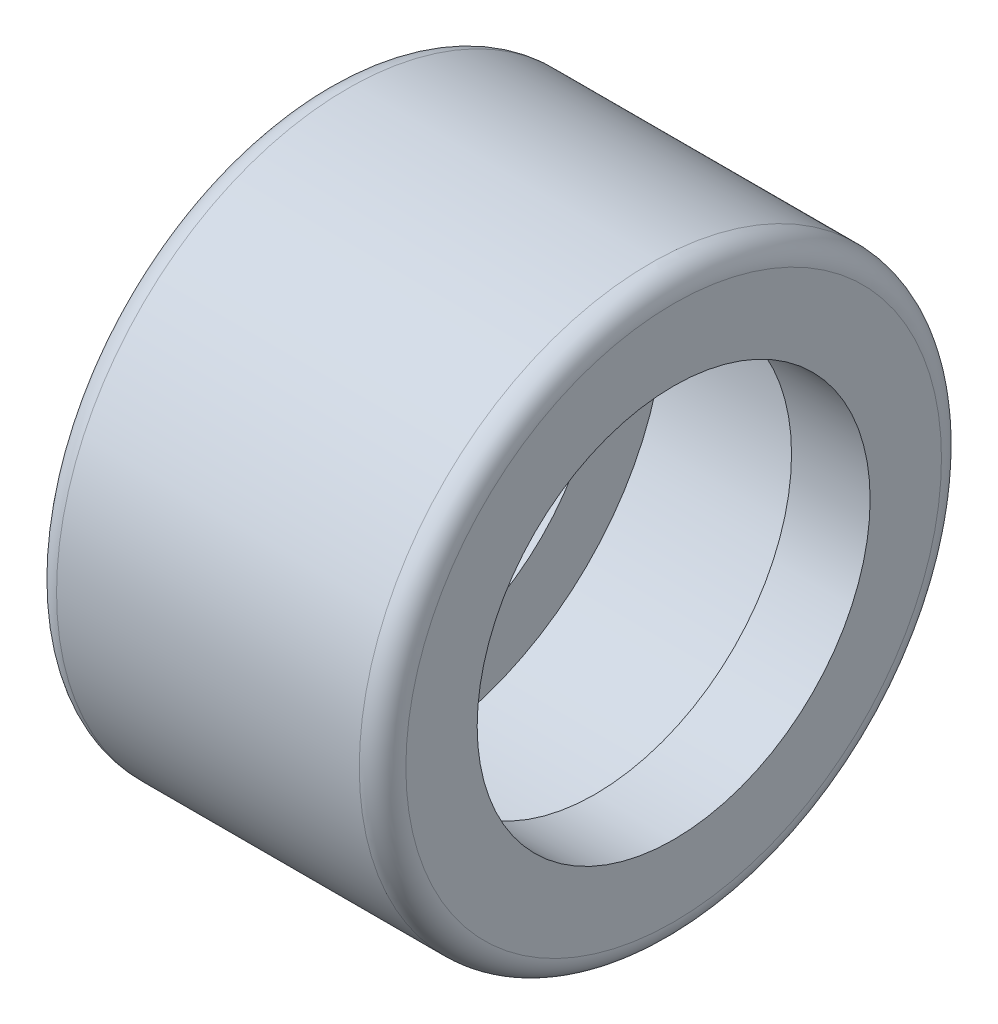
ISO-10303-21;
HEADER;
FILE_DESCRIPTION(('STEP AP214'),'2;1');
FILE_NAME('part.step','',(''),(''),'','','');
FILE_SCHEMA(('AUTOMOTIVE_DESIGN { 1 0 10303 214 1 1 1 1 }'));
ENDSEC;
DATA;
#1=APPLICATION_CONTEXT('core data for automotive mechanical design processes');
#2=APPLICATION_PROTOCOL_DEFINITION('international standard','automotive_design',2000,#1);
#3=PRODUCT_CONTEXT('',#1,'mechanical');
#4=PRODUCT('Part','Part','',(#3));
#5=PRODUCT_RELATED_PRODUCT_CATEGORY('part','',(#4));
#6=PRODUCT_DEFINITION_FORMATION('','',#4);
#7=PRODUCT_DEFINITION_CONTEXT('part definition',#1,'design');
#8=PRODUCT_DEFINITION('design','',#6,#7);
#9=PRODUCT_DEFINITION_SHAPE('','',#8);
#10=(LENGTH_UNIT() NAMED_UNIT(*) SI_UNIT(.MILLI.,.METRE.));
#11=(NAMED_UNIT(*) PLANE_ANGLE_UNIT() SI_UNIT($,.RADIAN.));
#12=(NAMED_UNIT(*) SI_UNIT($,.STERADIAN.) SOLID_ANGLE_UNIT());
#13=UNCERTAINTY_MEASURE_WITH_UNIT(LENGTH_MEASURE(1.E-05),#10,'distance_accuracy_value','');
#14=(GEOMETRIC_REPRESENTATION_CONTEXT(3) GLOBAL_UNCERTAINTY_ASSIGNED_CONTEXT((#13)) GLOBAL_UNIT_ASSIGNED_CONTEXT((#10,
#11,#12)) REPRESENTATION_CONTEXT('',''));
#15=CARTESIAN_POINT('',(0.,0.,0.));
#16=DIRECTION('',(0.,0.,1.));
#17=DIRECTION('',(1.,0.,0.));
#18=AXIS2_PLACEMENT_3D('',#15,#16,#17);
#19=CARTESIAN_POINT('',(0.40000000000003,0.,0.));
#20=DIRECTION('',(-1.,0.,0.));
#21=DIRECTION('',(0.,0.,1.));
#22=AXIS2_PLACEMENT_3D('',#19,#20,#21);
#23=TOROIDAL_SURFACE('',#22,4.59999999999997,0.40000000000003);
#24=CARTESIAN_POINT('',(0.,0.,0.));
#25=DIRECTION('',(-1.,0.,0.));
#26=DIRECTION('',(0.,0.,1.));
#27=AXIS2_PLACEMENT_3D('',#24,#25,#26);
#28=CIRCLE('',#27,4.6);
#29=CARTESIAN_POINT('',(0.,0.,4.6));
#30=VERTEX_POINT('',#29);
#31=EDGE_CURVE('E10',#30,#30,#28,.T.);
#32=ORIENTED_EDGE('',*,*,#31,.F.);
#33=EDGE_LOOP('',(#32));
#34=FACE_BOUND('',#33,.T.);
#35=CARTESIAN_POINT('',(0.399999999999998,0.,0.));
#36=DIRECTION('',(-1.,0.,0.));
#37=DIRECTION('',(0.,0.,1.));
#38=AXIS2_PLACEMENT_3D('',#35,#36,#37);
#39=CIRCLE('',#38,5.);
#40=CARTESIAN_POINT('',(0.399999999999998,0.,5.));
#41=VERTEX_POINT('',#40);
#42=EDGE_CURVE('E65',#41,#41,#39,.T.);
#43=ORIENTED_EDGE('',*,*,#42,.T.);
#44=EDGE_LOOP('',(#43));
#45=FACE_BOUND('',#44,.T.);
#46=ADVANCED_FACE('F31',(#34,#45),#23,.T.);
#47=CARTESIAN_POINT('',(0.,4.6,0.));
#48=DIRECTION('',(1.,0.,0.));
#49=DIRECTION('',(0.,0.,-1.));
#50=AXIS2_PLACEMENT_3D('',#47,#48,#49);
#51=PLANE('',#50);
#52=CARTESIAN_POINT('',(0.,0.,0.));
#53=DIRECTION('',(-1.,0.,0.));
#54=DIRECTION('',(0.,0.,1.));
#55=AXIS2_PLACEMENT_3D('',#52,#53,#54);
#56=CIRCLE('',#55,3.375);
#57=CARTESIAN_POINT('',(0.,0.,3.375));
#58=VERTEX_POINT('',#57);
#59=EDGE_CURVE('E37',#58,#58,#56,.T.);
#60=ORIENTED_EDGE('',*,*,#59,.F.);
#61=EDGE_LOOP('',(#60));
#62=FACE_BOUND('',#61,.T.);
#63=ORIENTED_EDGE('',*,*,#31,.T.);
#64=EDGE_LOOP('',(#63));
#65=FACE_BOUND('',#64,.T.);
#66=ADVANCED_FACE('F114',(#62,#65),#51,.F.);
#67=CARTESIAN_POINT('',(50.,0.,0.));
#68=DIRECTION('',(-1.,0.,0.));
#69=DIRECTION('',(0.,0.,1.));
#70=AXIS2_PLACEMENT_3D('',#67,#68,#69);
#71=CYLINDRICAL_SURFACE('',#70,3.375);
#72=CARTESIAN_POINT('',(1.35,0.,0.));
#73=DIRECTION('',(-1.,0.,0.));
#74=DIRECTION('',(0.,0.,1.));
#75=AXIS2_PLACEMENT_3D('',#72,#73,#74);
#76=CIRCLE('',#75,3.375);
#77=CARTESIAN_POINT('',(1.35,0.,3.375));
#78=VERTEX_POINT('',#77);
#79=EDGE_CURVE('E41',#78,#78,#76,.T.);
#80=ORIENTED_EDGE('',*,*,#79,.F.);
#81=EDGE_LOOP('',(#80));
#82=FACE_BOUND('',#81,.T.);
#83=ORIENTED_EDGE('',*,*,#59,.T.);
#84=EDGE_LOOP('',(#83));
#85=FACE_BOUND('',#84,.T.);
#86=ADVANCED_FACE('F109',(#82,#85),#71,.F.);
#87=CARTESIAN_POINT('',(1.35,3.375,0.));
#88=DIRECTION('',(-1.,0.,0.));
#89=DIRECTION('',(0.,0.,1.));
#90=AXIS2_PLACEMENT_3D('',#87,#88,#89);
#91=PLANE('',#90);
#92=CARTESIAN_POINT('',(1.35,0.,0.));
#93=DIRECTION('',(-1.,0.,0.));
#94=DIRECTION('',(0.,0.,1.));
#95=AXIS2_PLACEMENT_3D('',#92,#93,#94);
#96=CIRCLE('',#95,4.5);
#97=CARTESIAN_POINT('',(1.35,0.,4.5));
#98=VERTEX_POINT('',#97);
#99=EDGE_CURVE('E45',#98,#98,#96,.T.);
#100=ORIENTED_EDGE('',*,*,#99,.F.);
#101=EDGE_LOOP('',(#100));
#102=FACE_BOUND('',#101,.T.);
#103=ORIENTED_EDGE('',*,*,#79,.T.);
#104=EDGE_LOOP('',(#103));
#105=FACE_BOUND('',#104,.T.);
#106=ADVANCED_FACE('F103',(#102,#105),#91,.F.);
#107=CARTESIAN_POINT('',(50.,0.,0.));
#108=DIRECTION('',(-1.,0.,0.));
#109=DIRECTION('',(0.,0.,1.));
#110=AXIS2_PLACEMENT_3D('',#107,#108,#109);
#111=CYLINDRICAL_SURFACE('',#110,4.5);
#112=CARTESIAN_POINT('',(4.65,0.,0.));
#113=DIRECTION('',(-1.,0.,0.));
#114=DIRECTION('',(0.,0.,1.));
#115=AXIS2_PLACEMENT_3D('',#112,#113,#114);
#116=CIRCLE('',#115,4.5);
#117=CARTESIAN_POINT('',(4.65,0.,4.5));
#118=VERTEX_POINT('',#117);
#119=EDGE_CURVE('E50',#118,#118,#116,.T.);
#120=ORIENTED_EDGE('',*,*,#119,.F.);
#121=EDGE_LOOP('',(#120));
#122=FACE_BOUND('',#121,.T.);
#123=ORIENTED_EDGE('',*,*,#99,.T.);
#124=EDGE_LOOP('',(#123));
#125=FACE_BOUND('',#124,.T.);
#126=ADVANCED_FACE('F97',(#122,#125),#111,.F.);
#127=CARTESIAN_POINT('',(4.65,4.5,0.));
#128=DIRECTION('',(1.,0.,0.));
#129=DIRECTION('',(0.,0.,-1.));
#130=AXIS2_PLACEMENT_3D('',#127,#128,#129);
#131=PLANE('',#130);
#132=CARTESIAN_POINT('',(4.65,0.,0.));
#133=DIRECTION('',(-1.,0.,0.));
#134=DIRECTION('',(0.,0.,1.));
#135=AXIS2_PLACEMENT_3D('',#132,#133,#134);
#136=CIRCLE('',#135,3.375);
#137=CARTESIAN_POINT('',(4.65,0.,3.375));
#138=VERTEX_POINT('',#137);
#139=EDGE_CURVE('E53',#138,#138,#136,.T.);
#140=ORIENTED_EDGE('',*,*,#139,.F.);
#141=EDGE_LOOP('',(#140));
#142=FACE_BOUND('',#141,.T.);
#143=ORIENTED_EDGE('',*,*,#119,.T.);
#144=EDGE_LOOP('',(#143));
#145=FACE_BOUND('',#144,.T.);
#146=ADVANCED_FACE('F91',(#142,#145),#131,.F.);
#147=CARTESIAN_POINT('',(50.,0.,0.));
#148=DIRECTION('',(-1.,0.,0.));
#149=DIRECTION('',(0.,0.,1.));
#150=AXIS2_PLACEMENT_3D('',#147,#148,#149);
#151=CYLINDRICAL_SURFACE('',#150,3.375);
#152=CARTESIAN_POINT('',(6.,0.,0.));
#153=DIRECTION('',(-1.,0.,0.));
#154=DIRECTION('',(0.,0.,1.));
#155=AXIS2_PLACEMENT_3D('',#152,#153,#154);
#156=CIRCLE('',#155,3.375);
#157=CARTESIAN_POINT('',(6.,0.,3.375));
#158=VERTEX_POINT('',#157);
#159=EDGE_CURVE('E56',#158,#158,#156,.T.);
#160=ORIENTED_EDGE('',*,*,#159,.F.);
#161=EDGE_LOOP('',(#160));
#162=FACE_BOUND('',#161,.T.);
#163=ORIENTED_EDGE('',*,*,#139,.T.);
#164=EDGE_LOOP('',(#163));
#165=FACE_BOUND('',#164,.T.);
#166=ADVANCED_FACE('F85',(#162,#165),#151,.F.);
#167=CARTESIAN_POINT('',(6.,3.375,0.));
#168=DIRECTION('',(-1.,0.,0.));
#169=DIRECTION('',(0.,0.,1.));
#170=AXIS2_PLACEMENT_3D('',#167,#168,#169);
#171=PLANE('',#170);
#172=CARTESIAN_POINT('',(6.,0.,0.));
#173=DIRECTION('',(-1.,0.,0.));
#174=DIRECTION('',(0.,0.,1.));
#175=AXIS2_PLACEMENT_3D('',#172,#173,#174);
#176=CIRCLE('',#175,4.6);
#177=CARTESIAN_POINT('',(6.,0.,4.6));
#178=VERTEX_POINT('',#177);
#179=EDGE_CURVE('E59',#178,#178,#176,.T.);
#180=ORIENTED_EDGE('',*,*,#179,.F.);
#181=EDGE_LOOP('',(#180));
#182=FACE_BOUND('',#181,.T.);
#183=ORIENTED_EDGE('',*,*,#159,.T.);
#184=EDGE_LOOP('',(#183));
#185=FACE_BOUND('',#184,.T.);
#186=ADVANCED_FACE('F79',(#182,#185),#171,.F.);
#187=CARTESIAN_POINT('',(5.59999999999994,0.,0.));
#188=DIRECTION('',(-1.,0.,0.));
#189=DIRECTION('',(0.,0.,1.));
#190=AXIS2_PLACEMENT_3D('',#187,#188,#189);
#191=TOROIDAL_SURFACE('',#190,4.59999999999994,0.400000000000064);
#192=CARTESIAN_POINT('',(5.6,0.,0.));
#193=DIRECTION('',(-1.,0.,0.));
#194=DIRECTION('',(0.,0.,1.));
#195=AXIS2_PLACEMENT_3D('',#192,#193,#194);
#196=CIRCLE('',#195,5.);
#197=CARTESIAN_POINT('',(5.6,0.,5.));
#198=VERTEX_POINT('',#197);
#199=EDGE_CURVE('E62',#198,#198,#196,.T.);
#200=ORIENTED_EDGE('',*,*,#199,.F.);
#201=EDGE_LOOP('',(#200));
#202=FACE_BOUND('',#201,.T.);
#203=ORIENTED_EDGE('',*,*,#179,.T.);
#204=EDGE_LOOP('',(#203));
#205=FACE_BOUND('',#204,.T.);
#206=ADVANCED_FACE('F73',(#202,#205),#191,.T.);
#207=CARTESIAN_POINT('',(50.,0.,0.));
#208=DIRECTION('',(-1.,0.,0.));
#209=DIRECTION('',(0.,0.,1.));
#210=AXIS2_PLACEMENT_3D('',#207,#208,#209);
#211=CYLINDRICAL_SURFACE('',#210,5.);
#212=ORIENTED_EDGE('',*,*,#42,.F.);
#213=EDGE_LOOP('',(#212));
#214=FACE_BOUND('',#213,.T.);
#215=ORIENTED_EDGE('',*,*,#199,.T.);
#216=EDGE_LOOP('',(#215));
#217=FACE_BOUND('',#216,.T.);
#218=ADVANCED_FACE('F70',(#214,#217),#211,.T.);
#219=CLOSED_SHELL('',(#46,#66,#86,#106,#126,#146,#166,#186,#206,#218));
#220=MANIFOLD_SOLID_BREP('B2',#219);
#221=ADVANCED_BREP_SHAPE_REPRESENTATION('',(#18,#220),#14);
#222=SHAPE_DEFINITION_REPRESENTATION(#9,#221);
ENDSEC;
END-ISO-10303-21;
